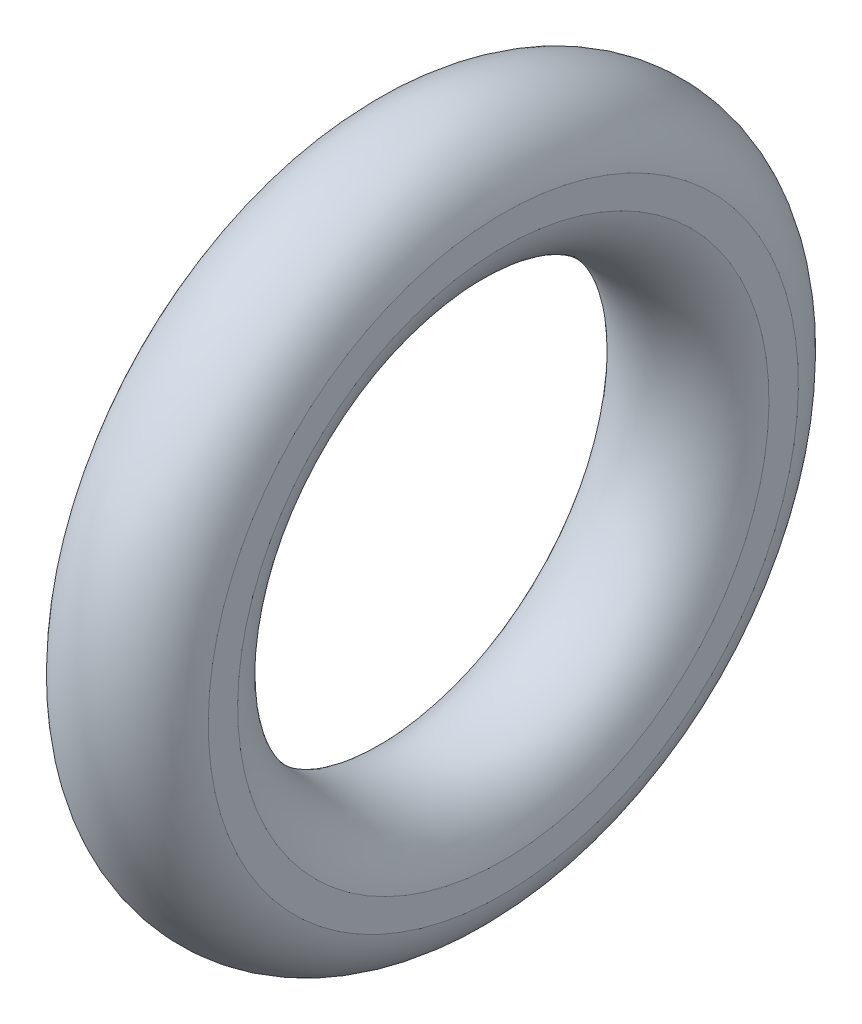
ISO-10303-21;
HEADER;
FILE_DESCRIPTION(('STEP AP214'),'2;1');
FILE_NAME('part.step','',(''),(''),'','','');
FILE_SCHEMA(('AUTOMOTIVE_DESIGN { 1 0 10303 214 1 1 1 1 }'));
ENDSEC;
DATA;
#1=APPLICATION_CONTEXT('core data for automotive mechanical design processes');
#2=APPLICATION_PROTOCOL_DEFINITION('international standard','automotive_design',2000,#1);
#3=PRODUCT_CONTEXT('',#1,'mechanical');
#4=PRODUCT('Part','Part','',(#3));
#5=PRODUCT_RELATED_PRODUCT_CATEGORY('part','',(#4));
#6=PRODUCT_DEFINITION_FORMATION('','',#4);
#7=PRODUCT_DEFINITION_CONTEXT('part definition',#1,'design');
#8=PRODUCT_DEFINITION('design','',#6,#7);
#9=PRODUCT_DEFINITION_SHAPE('','',#8);
#10=(LENGTH_UNIT() NAMED_UNIT(*) SI_UNIT(.MILLI.,.METRE.));
#11=(NAMED_UNIT(*) PLANE_ANGLE_UNIT() SI_UNIT($,.RADIAN.));
#12=(NAMED_UNIT(*) SI_UNIT($,.STERADIAN.) SOLID_ANGLE_UNIT());
#13=UNCERTAINTY_MEASURE_WITH_UNIT(LENGTH_MEASURE(1.E-05),#10,'distance_accuracy_value','');
#14=(GEOMETRIC_REPRESENTATION_CONTEXT(3) GLOBAL_UNCERTAINTY_ASSIGNED_CONTEXT((#13)) GLOBAL_UNIT_ASSIGNED_CONTEXT((#10,
#11,#12)) REPRESENTATION_CONTEXT('',''));
#15=CARTESIAN_POINT('',(0.,0.,0.));
#16=DIRECTION('',(0.,0.,1.));
#17=DIRECTION('',(1.,0.,0.));
#18=AXIS2_PLACEMENT_3D('',#15,#16,#17);
#19=CARTESIAN_POINT('',(0.3048,-0.139864772913332,-2.53550869560241));
#20=DIRECTION('',(-1.,0.,0.));
#21=DIRECTION('',(0.,0.,1.));
#22=AXIS2_PLACEMENT_3D('',#19,#20,#21);
#23=PLANE('',#22);
#24=CARTESIAN_POINT('',(0.3048,0.,0.));
#25=DIRECTION('',(-1.,0.,0.));
#26=DIRECTION('',(0.,0.998482017617769,-0.0550786754919707));
#27=AXIS2_PLACEMENT_3D('',#24,#25,#26);
#28=CIRCLE('',#27,2.28663659548746);
#29=CARTESIAN_POINT('',(0.3048,2.28316552142094,-0.125944915010918));
#30=VERTEX_POINT('',#29);
#31=EDGE_CURVE('E56',#30,#30,#28,.T.);
#32=ORIENTED_EDGE('',*,*,#31,.T.);
#33=EDGE_LOOP('',(#32));
#34=FACE_BOUND('',#33,.T.);
#35=CARTESIAN_POINT('',(0.3048,0.,0.));
#36=DIRECTION('',(-1.,0.,0.));
#37=DIRECTION('',(0.,0.998482017617769,-0.0550786754919707));
#38=AXIS2_PLACEMENT_3D('',#35,#36,#37);
#39=CIRCLE('',#38,2.53936340451254);
#40=CARTESIAN_POINT('',(0.3048,-2.53550869560241,0.139864772913332));
#41=VERTEX_POINT('',#40);
#42=EDGE_CURVE('E27',#41,#41,#39,.T.);
#43=ORIENTED_EDGE('',*,*,#42,.F.);
#44=EDGE_LOOP('',(#43));
#45=FACE_BOUND('',#44,.T.);
#46=ADVANCED_FACE('F17',(#34,#45),#23,.F.);
#47=CARTESIAN_POINT('',(-0.9398,-0.139864772913332,-2.53550869560241));
#48=DIRECTION('',(1.,0.,0.));
#49=DIRECTION('',(0.,1.,0.));
#50=AXIS2_PLACEMENT_3D('',#47,#48,#49);
#51=PLANE('',#50);
#52=CARTESIAN_POINT('',(-0.9398,0.,0.));
#53=DIRECTION('',(-1.,0.,0.));
#54=DIRECTION('',(0.,0.998482017617769,-0.0550786754919707));
#55=AXIS2_PLACEMENT_3D('',#52,#53,#54);
#56=CIRCLE('',#55,2.28663659548746);
#57=CARTESIAN_POINT('',(-0.9398,-2.28316552142094,0.125944915010918));
#58=VERTEX_POINT('',#57);
#59=EDGE_CURVE('E21',#58,#58,#56,.T.);
#60=ORIENTED_EDGE('',*,*,#59,.F.);
#61=EDGE_LOOP('',(#60));
#62=FACE_BOUND('',#61,.T.);
#63=CARTESIAN_POINT('',(-0.9398,0.,0.));
#64=DIRECTION('',(-1.,0.,0.));
#65=DIRECTION('',(0.,0.998482017617769,-0.0550786754919707));
#66=AXIS2_PLACEMENT_3D('',#63,#64,#65);
#67=CIRCLE('',#66,2.53936340451254);
#68=CARTESIAN_POINT('',(-0.9398,2.53550869560241,-0.139864772913332));
#69=VERTEX_POINT('',#68);
#70=EDGE_CURVE('E11',#69,#69,#67,.T.);
#71=ORIENTED_EDGE('',*,*,#70,.T.);
#72=EDGE_LOOP('',(#71));
#73=FACE_BOUND('',#72,.T.);
#74=ADVANCED_FACE('F19',(#62,#73),#51,.F.);
#75=CARTESIAN_POINT('',(-0.3175,0.,0.));
#76=DIRECTION('',(-1.,0.,0.));
#77=DIRECTION('',(0.,0.998482017617769,-0.0550786754919707));
#78=AXIS2_PLACEMENT_3D('',#75,#76,#77);
#79=TOROIDAL_SURFACE('',#78,2.413,0.635);
#80=ORIENTED_EDGE('',*,*,#70,.F.);
#81=EDGE_LOOP('',(#80));
#82=FACE_BOUND('',#81,.T.);
#83=ORIENTED_EDGE('',*,*,#42,.T.);
#84=EDGE_LOOP('',(#83));
#85=FACE_BOUND('',#84,.T.);
#86=ADVANCED_FACE('F98',(#82,#85),#79,.T.);
#87=CARTESIAN_POINT('',(-0.3175,0.,0.));
#88=DIRECTION('',(-1.,0.,0.));
#89=DIRECTION('',(0.,0.998482017617769,-0.0550786754919707));
#90=AXIS2_PLACEMENT_3D('',#87,#88,#89);
#91=TOROIDAL_SURFACE('',#90,2.413,0.635);
#92=ORIENTED_EDGE('',*,*,#59,.T.);
#93=EDGE_LOOP('',(#92));
#94=FACE_BOUND('',#93,.T.);
#95=ORIENTED_EDGE('',*,*,#31,.F.);
#96=EDGE_LOOP('',(#95));
#97=FACE_BOUND('',#96,.T.);
#98=ADVANCED_FACE('F94',(#94,#97),#91,.T.);
#99=CLOSED_SHELL('',(#46,#74,#86,#98));
#100=MANIFOLD_SOLID_BREP('B1',#99);
#101=ADVANCED_BREP_SHAPE_REPRESENTATION('',(#18,#100),#14);
#102=SHAPE_DEFINITION_REPRESENTATION(#9,#101);
ENDSEC;
END-ISO-10303-21;
